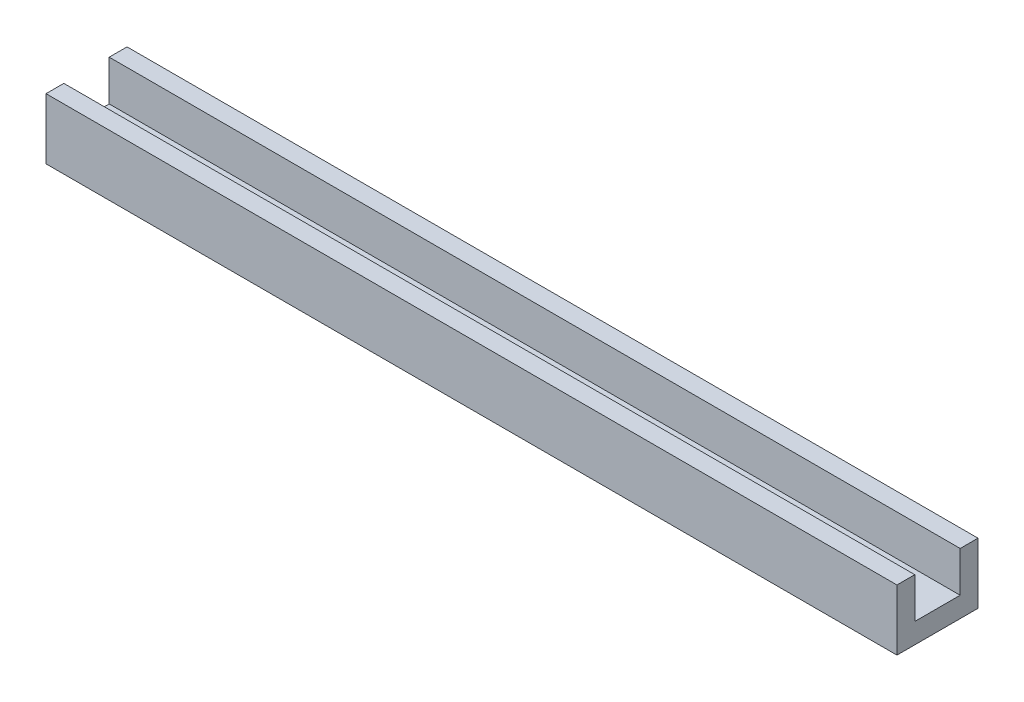
ISO-10303-21;
HEADER;
FILE_DESCRIPTION(('STEP AP214'),'2;1');
FILE_NAME('part.step','',(''),(''),'','','');
FILE_SCHEMA(('AUTOMOTIVE_DESIGN { 1 0 10303 214 1 1 1 1 }'));
ENDSEC;
DATA;
#1=APPLICATION_CONTEXT('core data for automotive mechanical design processes');
#2=APPLICATION_PROTOCOL_DEFINITION('international standard','automotive_design',2000,#1);
#3=PRODUCT_CONTEXT('',#1,'mechanical');
#4=PRODUCT('Part','Part','',(#3));
#5=PRODUCT_RELATED_PRODUCT_CATEGORY('part','',(#4));
#6=PRODUCT_DEFINITION_FORMATION('','',#4);
#7=PRODUCT_DEFINITION_CONTEXT('part definition',#1,'design');
#8=PRODUCT_DEFINITION('design','',#6,#7);
#9=PRODUCT_DEFINITION_SHAPE('','',#8);
#10=(LENGTH_UNIT() NAMED_UNIT(*) SI_UNIT(.MILLI.,.METRE.));
#11=(NAMED_UNIT(*) PLANE_ANGLE_UNIT() SI_UNIT($,.RADIAN.));
#12=(NAMED_UNIT(*) SI_UNIT($,.STERADIAN.) SOLID_ANGLE_UNIT());
#13=UNCERTAINTY_MEASURE_WITH_UNIT(LENGTH_MEASURE(1.E-05),#10,'distance_accuracy_value','');
#14=(GEOMETRIC_REPRESENTATION_CONTEXT(3) GLOBAL_UNCERTAINTY_ASSIGNED_CONTEXT((#13)) GLOBAL_UNIT_ASSIGNED_CONTEXT((#10,
#11,#12)) REPRESENTATION_CONTEXT('',''));
#15=CARTESIAN_POINT('',(0.,0.,0.));
#16=DIRECTION('',(0.,0.,1.));
#17=DIRECTION('',(1.,0.,0.));
#18=AXIS2_PLACEMENT_3D('',#15,#16,#17);
#19=CARTESIAN_POINT('',(0.,15.,0.));
#20=DIRECTION('',(0.,-1.,0.));
#21=DIRECTION('',(0.,0.,-1.));
#22=AXIS2_PLACEMENT_3D('',#19,#20,#21);
#23=PLANE('',#22);
#24=DIRECTION('',(1.,0.,0.));
#25=VECTOR('',#24,1.);
#26=CARTESIAN_POINT('',(210.,15.,-4.4));
#27=LINE('',#26,#25);
#28=CARTESIAN_POINT('',(0.,15.,-4.4));
#29=VERTEX_POINT('',#28);
#30=CARTESIAN_POINT('',(210.,15.,-4.4));
#31=VERTEX_POINT('',#30);
#32=EDGE_CURVE('E145',#29,#31,#27,.T.);
#33=ORIENTED_EDGE('',*,*,#32,.F.);
#34=DIRECTION('',(0.,0.,1.));
#35=VECTOR('',#34,1.);
#36=CARTESIAN_POINT('',(0.,15.,0.));
#37=LINE('',#36,#35);
#38=CARTESIAN_POINT('',(0.,15.,0.));
#39=VERTEX_POINT('',#38);
#40=EDGE_CURVE('E93',#29,#39,#37,.T.);
#41=ORIENTED_EDGE('',*,*,#40,.T.);
#42=DIRECTION('',(1.,0.,0.));
#43=VECTOR('',#42,1.);
#44=CARTESIAN_POINT('',(0.,15.,0.));
#45=LINE('',#44,#43);
#46=CARTESIAN_POINT('',(210.,15.,0.));
#47=VERTEX_POINT('',#46);
#48=EDGE_CURVE('E195',#39,#47,#45,.T.);
#49=ORIENTED_EDGE('',*,*,#48,.T.);
#50=DIRECTION('',(0.,0.,-1.));
#51=VECTOR('',#50,1.);
#52=CARTESIAN_POINT('',(210.,15.,0.));
#53=LINE('',#52,#51);
#54=EDGE_CURVE('E199',#47,#31,#53,.T.);
#55=ORIENTED_EDGE('',*,*,#54,.T.);
#56=EDGE_LOOP('',(#33,#41,#49,#55));
#57=FACE_BOUND('',#56,.T.);
#58=ADVANCED_FACE('F41',(#57),#23,.F.);
#59=DIRECTION('',(-1.,0.,0.));
#60=VECTOR('',#59,1.);
#61=CARTESIAN_POINT('',(210.,15.,-15.6));
#62=LINE('',#61,#60);
#63=CARTESIAN_POINT('',(210.,15.,-15.6));
#64=VERTEX_POINT('',#63);
#65=CARTESIAN_POINT('',(0.,15.,-15.6));
#66=VERTEX_POINT('',#65);
#67=EDGE_CURVE('E155',#64,#66,#62,.T.);
#68=ORIENTED_EDGE('',*,*,#67,.F.);
#69=CARTESIAN_POINT('',(210.,15.,-20.));
#70=VERTEX_POINT('',#69);
#71=EDGE_CURVE('E198',#64,#70,#53,.T.);
#72=ORIENTED_EDGE('',*,*,#71,.T.);
#73=DIRECTION('',(-1.,0.,0.));
#74=VECTOR('',#73,1.);
#75=CARTESIAN_POINT('',(0.,15.,-20.));
#76=LINE('',#75,#74);
#77=CARTESIAN_POINT('',(0.,15.,-20.));
#78=VERTEX_POINT('',#77);
#79=EDGE_CURVE('E61',#70,#78,#76,.T.);
#80=ORIENTED_EDGE('',*,*,#79,.T.);
#81=EDGE_CURVE('E192',#78,#66,#37,.T.);
#82=ORIENTED_EDGE('',*,*,#81,.T.);
#83=EDGE_LOOP('',(#68,#72,#80,#82));
#84=FACE_BOUND('',#83,.T.);
#85=ADVANCED_FACE('F238',(#84),#23,.F.);
#86=CARTESIAN_POINT('',(92.223887678587,0.,-10.));
#87=DIRECTION('',(0.,1.,0.));
#88=DIRECTION('',(0.,0.,1.));
#89=AXIS2_PLACEMENT_3D('',#86,#87,#88);
#90=CYLINDRICAL_SURFACE('',#89,1.8);
#91=CARTESIAN_POINT('',(92.223887678587,0.,-10.));
#92=DIRECTION('',(0.,-1.,0.));
#93=DIRECTION('',(0.,0.,1.));
#94=AXIS2_PLACEMENT_3D('',#91,#92,#93);
#95=CIRCLE('',#94,1.8);
#96=CARTESIAN_POINT('',(92.223887678587,0.,-8.2));
#97=VERTEX_POINT('',#96);
#98=EDGE_CURVE('E173',#97,#97,#95,.T.);
#99=ORIENTED_EDGE('',*,*,#98,.T.);
#100=EDGE_LOOP('',(#99));
#101=FACE_BOUND('',#100,.T.);
#102=CARTESIAN_POINT('',(92.223887678587,1.4,-10.));
#103=DIRECTION('',(0.,1.,0.));
#104=DIRECTION('',(0.,0.,1.));
#105=AXIS2_PLACEMENT_3D('',#102,#103,#104);
#106=CIRCLE('',#105,1.8);
#107=CARTESIAN_POINT('',(92.223887678587,1.4,-8.2));
#108=VERTEX_POINT('',#107);
#109=EDGE_CURVE('E45',#108,#108,#106,.T.);
#110=ORIENTED_EDGE('',*,*,#109,.T.);
#111=EDGE_LOOP('',(#110));
#112=FACE_BOUND('',#111,.T.);
#113=ADVANCED_FACE('F229',(#101,#112),#90,.F.);
#114=CARTESIAN_POINT('',(25.,0.,-10.));
#115=DIRECTION('',(0.,1.,0.));
#116=DIRECTION('',(0.,0.,1.));
#117=AXIS2_PLACEMENT_3D('',#114,#115,#116);
#118=CYLINDRICAL_SURFACE('',#117,1.8);
#119=CARTESIAN_POINT('',(25.,0.,-10.));
#120=DIRECTION('',(0.,1.,0.));
#121=DIRECTION('',(0.,0.,1.));
#122=AXIS2_PLACEMENT_3D('',#119,#120,#121);
#123=CIRCLE('',#122,1.8);
#124=CARTESIAN_POINT('',(25.,0.,-8.2));
#125=VERTEX_POINT('',#124);
#126=EDGE_CURVE('E186',#125,#125,#123,.T.);
#127=ORIENTED_EDGE('',*,*,#126,.F.);
#128=EDGE_LOOP('',(#127));
#129=FACE_BOUND('',#128,.T.);
#130=CARTESIAN_POINT('',(25.,1.4,-10.));
#131=DIRECTION('',(0.,1.,0.));
#132=DIRECTION('',(0.,0.,1.));
#133=AXIS2_PLACEMENT_3D('',#130,#131,#132);
#134=CIRCLE('',#133,1.8);
#135=CARTESIAN_POINT('',(25.,1.4,-8.2));
#136=VERTEX_POINT('',#135);
#137=EDGE_CURVE('E182',#136,#136,#134,.F.);
#138=ORIENTED_EDGE('',*,*,#137,.F.);
#139=EDGE_LOOP('',(#138));
#140=FACE_BOUND('',#139,.T.);
#141=ADVANCED_FACE('F227',(#129,#140),#118,.F.);
#142=CARTESIAN_POINT('',(0.,15.,0.));
#143=DIRECTION('',(1.,0.,0.));
#144=DIRECTION('',(0.,0.,-1.));
#145=AXIS2_PLACEMENT_3D('',#142,#143,#144);
#146=PLANE('',#145);
#147=DIRECTION('',(0.,1.,0.));
#148=VECTOR('',#147,1.);
#149=CARTESIAN_POINT('',(0.,15.,-4.4));
#150=LINE('',#149,#148);
#151=CARTESIAN_POINT('',(0.,5.,-4.4));
#152=VERTEX_POINT('',#151);
#153=EDGE_CURVE('E142',#152,#29,#150,.T.);
#154=ORIENTED_EDGE('',*,*,#153,.F.);
#155=DIRECTION('',(0.,0.,1.));
#156=VECTOR('',#155,1.);
#157=CARTESIAN_POINT('',(0.,5.,-5.));
#158=LINE('',#157,#156);
#159=CARTESIAN_POINT('',(0.,5.,-15.6));
#160=VERTEX_POINT('',#159);
#161=EDGE_CURVE('E134',#160,#152,#158,.T.);
#162=ORIENTED_EDGE('',*,*,#161,.F.);
#163=DIRECTION('',(0.,-1.,0.));
#164=VECTOR('',#163,1.);
#165=CARTESIAN_POINT('',(0.,5.,-15.6));
#166=LINE('',#165,#164);
#167=EDGE_CURVE('E158',#66,#160,#166,.T.);
#168=ORIENTED_EDGE('',*,*,#167,.F.);
#169=ORIENTED_EDGE('',*,*,#81,.F.);
#170=DIRECTION('',(0.,-1.,0.));
#171=VECTOR('',#170,1.);
#172=CARTESIAN_POINT('',(0.,15.,-20.));
#173=LINE('',#172,#171);
#174=CARTESIAN_POINT('',(0.,0.,-20.));
#175=VERTEX_POINT('',#174);
#176=EDGE_CURVE('E204',#78,#175,#173,.T.);
#177=ORIENTED_EDGE('',*,*,#176,.T.);
#178=DIRECTION('',(0.,0.,1.));
#179=VECTOR('',#178,1.);
#180=CARTESIAN_POINT('',(0.,0.,0.));
#181=LINE('',#180,#179);
#182=CARTESIAN_POINT('',(0.,0.,0.));
#183=VERTEX_POINT('',#182);
#184=EDGE_CURVE('E133',#175,#183,#181,.T.);
#185=ORIENTED_EDGE('',*,*,#184,.T.);
#186=DIRECTION('',(0.,-1.,0.));
#187=VECTOR('',#186,1.);
#188=CARTESIAN_POINT('',(0.,15.,0.));
#189=LINE('',#188,#187);
#190=EDGE_CURVE('E11',#39,#183,#189,.T.);
#191=ORIENTED_EDGE('',*,*,#190,.F.);
#192=ORIENTED_EDGE('',*,*,#40,.F.);
#193=EDGE_LOOP('',(#154,#162,#168,#169,#177,#185,#191,#192));
#194=FACE_BOUND('',#193,.T.);
#195=ADVANCED_FACE('F43',(#194),#146,.F.);
#196=CARTESIAN_POINT('',(0.,15.,0.));
#197=DIRECTION('',(0.,0.,-1.));
#198=DIRECTION('',(-1.,0.,0.));
#199=AXIS2_PLACEMENT_3D('',#196,#197,#198);
#200=PLANE('',#199);
#201=DIRECTION('',(1.,0.,0.));
#202=VECTOR('',#201,1.);
#203=CARTESIAN_POINT('',(0.,0.,0.));
#204=LINE('',#203,#202);
#205=CARTESIAN_POINT('',(210.,0.,0.));
#206=VERTEX_POINT('',#205);
#207=EDGE_CURVE('E208',#183,#206,#204,.T.);
#208=ORIENTED_EDGE('',*,*,#207,.T.);
#209=DIRECTION('',(0.,-1.,0.));
#210=VECTOR('',#209,1.);
#211=CARTESIAN_POINT('',(210.,15.,0.));
#212=LINE('',#211,#210);
#213=EDGE_CURVE('E52',#47,#206,#212,.T.);
#214=ORIENTED_EDGE('',*,*,#213,.F.);
#215=ORIENTED_EDGE('',*,*,#48,.F.);
#216=ORIENTED_EDGE('',*,*,#190,.T.);
#217=EDGE_LOOP('',(#208,#214,#215,#216));
#218=FACE_BOUND('',#217,.T.);
#219=ADVANCED_FACE('F236',(#218),#200,.F.);
#220=CARTESIAN_POINT('',(210.,15.,0.));
#221=DIRECTION('',(-1.,0.,0.));
#222=DIRECTION('',(0.,0.,1.));
#223=AXIS2_PLACEMENT_3D('',#220,#221,#222);
#224=PLANE('',#223);
#225=DIRECTION('',(0.,0.,-1.));
#226=VECTOR('',#225,1.);
#227=CARTESIAN_POINT('',(210.,5.,-5.));
#228=LINE('',#227,#226);
#229=CARTESIAN_POINT('',(210.,5.,-4.4));
#230=VERTEX_POINT('',#229);
#231=CARTESIAN_POINT('',(210.,5.,-15.6));
#232=VERTEX_POINT('',#231);
#233=EDGE_CURVE('E120',#230,#232,#228,.T.);
#234=ORIENTED_EDGE('',*,*,#233,.F.);
#235=DIRECTION('',(0.,-1.,0.));
#236=VECTOR('',#235,1.);
#237=CARTESIAN_POINT('',(210.,15.,-4.4));
#238=LINE('',#237,#236);
#239=EDGE_CURVE('E125',#31,#230,#238,.T.);
#240=ORIENTED_EDGE('',*,*,#239,.F.);
#241=ORIENTED_EDGE('',*,*,#54,.F.);
#242=ORIENTED_EDGE('',*,*,#213,.T.);
#243=DIRECTION('',(0.,0.,-1.));
#244=VECTOR('',#243,1.);
#245=CARTESIAN_POINT('',(210.,0.,0.));
#246=LINE('',#245,#244);
#247=CARTESIAN_POINT('',(210.,0.,-20.));
#248=VERTEX_POINT('',#247);
#249=EDGE_CURVE('E79',#206,#248,#246,.T.);
#250=ORIENTED_EDGE('',*,*,#249,.T.);
#251=DIRECTION('',(0.,-1.,0.));
#252=VECTOR('',#251,1.);
#253=CARTESIAN_POINT('',(210.,15.,-20.));
#254=LINE('',#253,#252);
#255=EDGE_CURVE('E217',#70,#248,#254,.T.);
#256=ORIENTED_EDGE('',*,*,#255,.F.);
#257=ORIENTED_EDGE('',*,*,#71,.F.);
#258=DIRECTION('',(0.,1.,0.));
#259=VECTOR('',#258,1.);
#260=CARTESIAN_POINT('',(210.,5.,-15.6));
#261=LINE('',#260,#259);
#262=EDGE_CURVE('E128',#232,#64,#261,.T.);
#263=ORIENTED_EDGE('',*,*,#262,.F.);
#264=EDGE_LOOP('',(#234,#240,#241,#242,#250,#256,#257,#263));
#265=FACE_BOUND('',#264,.T.);
#266=ADVANCED_FACE('F122',(#265),#224,.F.);
#267=CARTESIAN_POINT('',(0.,15.,-20.));
#268=DIRECTION('',(0.,0.,1.));
#269=DIRECTION('',(1.,0.,0.));
#270=AXIS2_PLACEMENT_3D('',#267,#268,#269);
#271=PLANE('',#270);
#272=DIRECTION('',(-1.,0.,0.));
#273=VECTOR('',#272,1.);
#274=CARTESIAN_POINT('',(0.,0.,-20.));
#275=LINE('',#274,#273);
#276=EDGE_CURVE('E85',#248,#175,#275,.T.);
#277=ORIENTED_EDGE('',*,*,#276,.T.);
#278=ORIENTED_EDGE('',*,*,#176,.F.);
#279=ORIENTED_EDGE('',*,*,#79,.F.);
#280=ORIENTED_EDGE('',*,*,#255,.T.);
#281=EDGE_LOOP('',(#277,#278,#279,#280));
#282=FACE_BOUND('',#281,.T.);
#283=ADVANCED_FACE('F253',(#282),#271,.F.);
#284=CARTESIAN_POINT('',(0.,0.,0.));
#285=DIRECTION('',(0.,-1.,0.));
#286=DIRECTION('',(0.,0.,-1.));
#287=AXIS2_PLACEMENT_3D('',#284,#285,#286);
#288=PLANE('',#287);
#289=ORIENTED_EDGE('',*,*,#98,.F.);
#290=EDGE_LOOP('',(#289));
#291=FACE_BOUND('',#290,.T.);
#292=ORIENTED_EDGE('',*,*,#126,.T.);
#293=EDGE_LOOP('',(#292));
#294=FACE_BOUND('',#293,.T.);
#295=ORIENTED_EDGE('',*,*,#184,.F.);
#296=ORIENTED_EDGE('',*,*,#276,.F.);
#297=ORIENTED_EDGE('',*,*,#249,.F.);
#298=ORIENTED_EDGE('',*,*,#207,.F.);
#299=EDGE_LOOP('',(#295,#296,#297,#298));
#300=FACE_BOUND('',#299,.T.);
#301=ADVANCED_FACE('F250',(#291,#294,#300),#288,.T.);
#302=CARTESIAN_POINT('',(0.,5.,0.));
#303=DIRECTION('',(0.,-1.,0.));
#304=DIRECTION('',(0.,0.,-1.));
#305=AXIS2_PLACEMENT_3D('',#302,#303,#304);
#306=PLANE('',#305);
#307=CARTESIAN_POINT('',(92.223887678587,5.,-10.));
#308=DIRECTION('',(0.,-1.,0.));
#309=DIRECTION('',(0.,0.,1.));
#310=AXIS2_PLACEMENT_3D('',#307,#308,#309);
#311=CIRCLE('',#310,3.5);
#312=CARTESIAN_POINT('',(92.223887678587,5.,-6.5));
#313=VERTEX_POINT('',#312);
#314=EDGE_CURVE('E165',#313,#313,#311,.T.);
#315=ORIENTED_EDGE('',*,*,#314,.T.);
#316=EDGE_LOOP('',(#315));
#317=FACE_BOUND('',#316,.T.);
#318=CARTESIAN_POINT('',(25.,5.,-10.));
#319=DIRECTION('',(0.,1.,0.));
#320=DIRECTION('',(0.,0.,1.));
#321=AXIS2_PLACEMENT_3D('',#318,#319,#320);
#322=CIRCLE('',#321,3.5);
#323=CARTESIAN_POINT('',(25.,5.,-6.5));
#324=VERTEX_POINT('',#323);
#325=EDGE_CURVE('E177',#324,#324,#322,.T.);
#326=ORIENTED_EDGE('',*,*,#325,.F.);
#327=EDGE_LOOP('',(#326));
#328=FACE_BOUND('',#327,.T.);
#329=ORIENTED_EDGE('',*,*,#161,.T.);
#330=DIRECTION('',(-1.,0.,0.));
#331=VECTOR('',#330,1.);
#332=CARTESIAN_POINT('',(210.,5.,-4.4));
#333=LINE('',#332,#331);
#334=EDGE_CURVE('E137',#230,#152,#333,.T.);
#335=ORIENTED_EDGE('',*,*,#334,.F.);
#336=ORIENTED_EDGE('',*,*,#233,.T.);
#337=DIRECTION('',(1.,0.,0.));
#338=VECTOR('',#337,1.);
#339=CARTESIAN_POINT('',(210.,5.,-15.6));
#340=LINE('',#339,#338);
#341=EDGE_CURVE('E162',#160,#232,#340,.T.);
#342=ORIENTED_EDGE('',*,*,#341,.F.);
#343=EDGE_LOOP('',(#329,#335,#336,#342));
#344=FACE_BOUND('',#343,.T.);
#345=ADVANCED_FACE('F138',(#317,#328,#344),#306,.F.);
#346=CARTESIAN_POINT('',(25.,1.4,-10.));
#347=DIRECTION('',(0.,1.,0.));
#348=DIRECTION('',(0.,0.,1.));
#349=AXIS2_PLACEMENT_3D('',#346,#347,#348);
#350=PLANE('',#349);
#351=CARTESIAN_POINT('',(25.,1.4,-10.));
#352=DIRECTION('',(0.,1.,0.));
#353=DIRECTION('',(0.,0.,1.));
#354=AXIS2_PLACEMENT_3D('',#351,#352,#353);
#355=CIRCLE('',#354,3.5);
#356=CARTESIAN_POINT('',(25.,1.4,-6.5));
#357=VERTEX_POINT('',#356);
#358=EDGE_CURVE('E178',#357,#357,#355,.T.);
#359=ORIENTED_EDGE('',*,*,#358,.T.);
#360=EDGE_LOOP('',(#359));
#361=FACE_BOUND('',#360,.T.);
#362=ORIENTED_EDGE('',*,*,#137,.T.);
#363=EDGE_LOOP('',(#362));
#364=FACE_BOUND('',#363,.T.);
#365=ADVANCED_FACE('F225',(#361,#364),#350,.T.);
#366=CARTESIAN_POINT('',(25.,1.4,-10.));
#367=DIRECTION('',(0.,1.,0.));
#368=DIRECTION('',(0.,0.,1.));
#369=AXIS2_PLACEMENT_3D('',#366,#367,#368);
#370=CYLINDRICAL_SURFACE('',#369,3.5);
#371=ORIENTED_EDGE('',*,*,#358,.F.);
#372=EDGE_LOOP('',(#371));
#373=FACE_BOUND('',#372,.T.);
#374=ORIENTED_EDGE('',*,*,#325,.T.);
#375=EDGE_LOOP('',(#374));
#376=FACE_BOUND('',#375,.T.);
#377=ADVANCED_FACE('F286',(#373,#376),#370,.F.);
#378=CARTESIAN_POINT('',(92.223887678587,1.4,-10.));
#379=DIRECTION('',(0.,1.,0.));
#380=DIRECTION('',(0.,0.,1.));
#381=AXIS2_PLACEMENT_3D('',#378,#379,#380);
#382=CYLINDRICAL_SURFACE('',#381,3.5);
#383=CARTESIAN_POINT('',(92.223887678587,1.4,-10.));
#384=DIRECTION('',(0.,-1.,0.));
#385=DIRECTION('',(0.,0.,1.));
#386=AXIS2_PLACEMENT_3D('',#383,#384,#385);
#387=CIRCLE('',#386,3.5);
#388=CARTESIAN_POINT('',(92.223887678587,1.4,-6.5));
#389=VERTEX_POINT('',#388);
#390=EDGE_CURVE('E166',#389,#389,#387,.T.);
#391=ORIENTED_EDGE('',*,*,#390,.T.);
#392=EDGE_LOOP('',(#391));
#393=FACE_BOUND('',#392,.T.);
#394=ORIENTED_EDGE('',*,*,#314,.F.);
#395=EDGE_LOOP('',(#394));
#396=FACE_BOUND('',#395,.T.);
#397=ADVANCED_FACE('F281',(#393,#396),#382,.F.);
#398=CARTESIAN_POINT('',(92.223887678587,1.4,-10.));
#399=DIRECTION('',(0.,1.,0.));
#400=DIRECTION('',(0.,0.,1.));
#401=AXIS2_PLACEMENT_3D('',#398,#399,#400);
#402=PLANE('',#401);
#403=ORIENTED_EDGE('',*,*,#109,.F.);
#404=EDGE_LOOP('',(#403));
#405=FACE_BOUND('',#404,.T.);
#406=ORIENTED_EDGE('',*,*,#390,.F.);
#407=EDGE_LOOP('',(#406));
#408=FACE_BOUND('',#407,.T.);
#409=ADVANCED_FACE('F274',(#405,#408),#402,.T.);
#410=CARTESIAN_POINT('',(0.,0.,-15.6));
#411=DIRECTION('',(0.,0.,1.));
#412=DIRECTION('',(1.,0.,0.));
#413=AXIS2_PLACEMENT_3D('',#410,#411,#412);
#414=PLANE('',#413);
#415=ORIENTED_EDGE('',*,*,#262,.T.);
#416=ORIENTED_EDGE('',*,*,#67,.T.);
#417=ORIENTED_EDGE('',*,*,#167,.T.);
#418=ORIENTED_EDGE('',*,*,#341,.T.);
#419=EDGE_LOOP('',(#415,#416,#417,#418));
#420=FACE_BOUND('',#419,.T.);
#421=ADVANCED_FACE('F272',(#420),#414,.T.);
#422=CARTESIAN_POINT('',(0.,0.,-4.4));
#423=DIRECTION('',(0.,0.,-1.));
#424=DIRECTION('',(-1.,0.,0.));
#425=AXIS2_PLACEMENT_3D('',#422,#423,#424);
#426=PLANE('',#425);
#427=ORIENTED_EDGE('',*,*,#239,.T.);
#428=ORIENTED_EDGE('',*,*,#334,.T.);
#429=ORIENTED_EDGE('',*,*,#153,.T.);
#430=ORIENTED_EDGE('',*,*,#32,.T.);
#431=EDGE_LOOP('',(#427,#428,#429,#430));
#432=FACE_BOUND('',#431,.T.);
#433=ADVANCED_FACE('F144',(#432),#426,.T.);
#434=CLOSED_SHELL('',(#58,#85,#113,#141,#195,#219,#266,#283,#301,#345,#365,#377,#397,#409,#421,#433));
#435=MANIFOLD_SOLID_BREP('B2',#434);
#436=ADVANCED_BREP_SHAPE_REPRESENTATION('',(#18,#435),#14);
#437=SHAPE_DEFINITION_REPRESENTATION(#9,#436);
ENDSEC;
END-ISO-10303-21;
